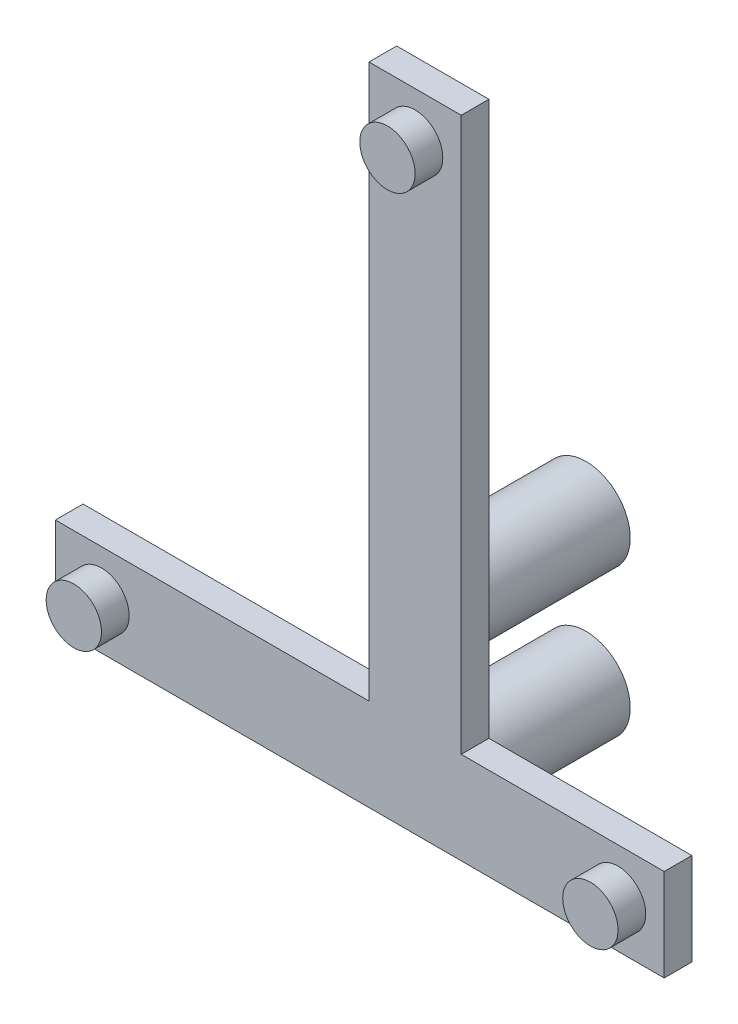
ISO-10303-21;
HEADER;
FILE_DESCRIPTION(('STEP AP214'),'2;1');
FILE_NAME('part.step','',(''),(''),'','','');
FILE_SCHEMA(('AUTOMOTIVE_DESIGN { 1 0 10303 214 1 1 1 1 }'));
ENDSEC;
DATA;
#1=APPLICATION_CONTEXT('core data for automotive mechanical design processes');
#2=APPLICATION_PROTOCOL_DEFINITION('international standard','automotive_design',2000,#1);
#3=PRODUCT_CONTEXT('',#1,'mechanical');
#4=PRODUCT('Part','Part','',(#3));
#5=PRODUCT_RELATED_PRODUCT_CATEGORY('part','',(#4));
#6=PRODUCT_DEFINITION_FORMATION('','',#4);
#7=PRODUCT_DEFINITION_CONTEXT('part definition',#1,'design');
#8=PRODUCT_DEFINITION('design','',#6,#7);
#9=PRODUCT_DEFINITION_SHAPE('','',#8);
#10=(LENGTH_UNIT() NAMED_UNIT(*) SI_UNIT(.MILLI.,.METRE.));
#11=(NAMED_UNIT(*) PLANE_ANGLE_UNIT() SI_UNIT($,.RADIAN.));
#12=(NAMED_UNIT(*) SI_UNIT($,.STERADIAN.) SOLID_ANGLE_UNIT());
#13=UNCERTAINTY_MEASURE_WITH_UNIT(LENGTH_MEASURE(1.E-05),#10,'distance_accuracy_value','');
#14=(GEOMETRIC_REPRESENTATION_CONTEXT(3) GLOBAL_UNCERTAINTY_ASSIGNED_CONTEXT((#13)) GLOBAL_UNIT_ASSIGNED_CONTEXT((#10,
#11,#12)) REPRESENTATION_CONTEXT('',''));
#15=CARTESIAN_POINT('',(0.,0.,0.));
#16=DIRECTION('',(0.,0.,1.));
#17=DIRECTION('',(1.,0.,0.));
#18=AXIS2_PLACEMENT_3D('',#15,#16,#17);
#19=CARTESIAN_POINT('',(-139.561248012313,21.0705350306475,1.5));
#20=DIRECTION('',(1.,0.,0.));
#21=DIRECTION('',(0.,0.,-1.));
#22=AXIS2_PLACEMENT_3D('',#19,#20,#21);
#23=PLANE('',#22);
#24=DIRECTION('',(0.,-1.,0.));
#25=VECTOR('',#24,1.);
#26=CARTESIAN_POINT('',(-139.561248012313,21.0705350306475,0.));
#27=LINE('',#26,#25);
#28=CARTESIAN_POINT('',(-139.561248012313,21.0705350306475,0.));
#29=VERTEX_POINT('',#28);
#30=CARTESIAN_POINT('',(-139.561248012313,16.0705350306475,0.));
#31=VERTEX_POINT('',#30);
#32=EDGE_CURVE('E130',#29,#31,#27,.T.);
#33=ORIENTED_EDGE('',*,*,#32,.T.);
#34=DIRECTION('',(0.,0.,-1.));
#35=VECTOR('',#34,1.);
#36=CARTESIAN_POINT('',(-139.561248012313,16.0705350306475,1.5));
#37=LINE('',#36,#35);
#38=CARTESIAN_POINT('',(-139.561248012313,16.0705350306475,1.5));
#39=VERTEX_POINT('',#38);
#40=EDGE_CURVE('E158',#39,#31,#37,.T.);
#41=ORIENTED_EDGE('',*,*,#40,.F.);
#42=DIRECTION('',(0.,-1.,0.));
#43=VECTOR('',#42,1.);
#44=CARTESIAN_POINT('',(-139.561248012313,21.0705350306475,1.5));
#45=LINE('',#44,#43);
#46=CARTESIAN_POINT('',(-139.561248012313,21.0705350306475,1.5));
#47=VERTEX_POINT('',#46);
#48=EDGE_CURVE('E145',#47,#39,#45,.T.);
#49=ORIENTED_EDGE('',*,*,#48,.F.);
#50=DIRECTION('',(0.,0.,-1.));
#51=VECTOR('',#50,1.);
#52=CARTESIAN_POINT('',(-139.561248012313,21.0705350306475,1.5));
#53=LINE('',#52,#51);
#54=EDGE_CURVE('E126',#47,#29,#53,.T.);
#55=ORIENTED_EDGE('',*,*,#54,.T.);
#56=EDGE_LOOP('',(#33,#41,#49,#55));
#57=FACE_BOUND('',#56,.T.);
#58=ADVANCED_FACE('F33',(#57),#23,.F.);
#59=CARTESIAN_POINT('',(-139.561248012313,16.0705350306475,1.5));
#60=DIRECTION('',(0.,1.,0.));
#61=DIRECTION('',(0.,0.,1.));
#62=AXIS2_PLACEMENT_3D('',#59,#60,#61);
#63=PLANE('',#62);
#64=DIRECTION('',(1.,0.,0.));
#65=VECTOR('',#64,1.);
#66=CARTESIAN_POINT('',(-139.561248012313,16.0705350306475,0.));
#67=LINE('',#66,#65);
#68=CARTESIAN_POINT('',(-106.561248012313,16.0705350306475,0.));
#69=VERTEX_POINT('',#68);
#70=EDGE_CURVE('E133',#31,#69,#67,.T.);
#71=ORIENTED_EDGE('',*,*,#70,.T.);
#72=DIRECTION('',(0.,0.,-1.));
#73=VECTOR('',#72,1.);
#74=CARTESIAN_POINT('',(-106.561248012313,16.0705350306475,1.5));
#75=LINE('',#74,#73);
#76=CARTESIAN_POINT('',(-106.561248012313,16.0705350306475,1.5));
#77=VERTEX_POINT('',#76);
#78=EDGE_CURVE('E155',#77,#69,#75,.T.);
#79=ORIENTED_EDGE('',*,*,#78,.F.);
#80=DIRECTION('',(1.,0.,0.));
#81=VECTOR('',#80,1.);
#82=CARTESIAN_POINT('',(-139.561248012313,16.0705350306475,1.5));
#83=LINE('',#82,#81);
#84=EDGE_CURVE('E93',#39,#77,#83,.T.);
#85=ORIENTED_EDGE('',*,*,#84,.F.);
#86=ORIENTED_EDGE('',*,*,#40,.T.);
#87=EDGE_LOOP('',(#71,#79,#85,#86));
#88=FACE_BOUND('',#87,.T.);
#89=ADVANCED_FACE('F216',(#88),#63,.F.);
#90=CARTESIAN_POINT('',(-106.561248012313,16.0705350306475,1.5));
#91=DIRECTION('',(-1.,0.,0.));
#92=DIRECTION('',(0.,0.,1.));
#93=AXIS2_PLACEMENT_3D('',#90,#91,#92);
#94=PLANE('',#93);
#95=DIRECTION('',(0.,1.,0.));
#96=VECTOR('',#95,1.);
#97=CARTESIAN_POINT('',(-106.561248012313,16.0705350306475,0.));
#98=LINE('',#97,#96);
#99=CARTESIAN_POINT('',(-106.561248012313,21.0705350306475,0.));
#100=VERTEX_POINT('',#99);
#101=EDGE_CURVE('E136',#69,#100,#98,.T.);
#102=ORIENTED_EDGE('',*,*,#101,.T.);
#103=DIRECTION('',(0.,0.,-1.));
#104=VECTOR('',#103,1.);
#105=CARTESIAN_POINT('',(-106.561248012313,21.0705350306475,1.5));
#106=LINE('',#105,#104);
#107=CARTESIAN_POINT('',(-106.561248012313,21.0705350306475,1.5));
#108=VERTEX_POINT('',#107);
#109=EDGE_CURVE('E152',#108,#100,#106,.T.);
#110=ORIENTED_EDGE('',*,*,#109,.F.);
#111=DIRECTION('',(0.,1.,0.));
#112=VECTOR('',#111,1.);
#113=CARTESIAN_POINT('',(-106.561248012313,16.0705350306475,1.5));
#114=LINE('',#113,#112);
#115=EDGE_CURVE('E184',#77,#108,#114,.T.);
#116=ORIENTED_EDGE('',*,*,#115,.F.);
#117=ORIENTED_EDGE('',*,*,#78,.T.);
#118=EDGE_LOOP('',(#102,#110,#116,#117));
#119=FACE_BOUND('',#118,.T.);
#120=ADVANCED_FACE('F220',(#119),#94,.F.);
#121=CARTESIAN_POINT('',(-106.561248012313,21.0705350306475,1.5));
#122=DIRECTION('',(0.,-1.,0.));
#123=DIRECTION('',(1.,0.,0.));
#124=AXIS2_PLACEMENT_3D('',#121,#122,#123);
#125=PLANE('',#124);
#126=DIRECTION('',(-1.,0.,0.));
#127=VECTOR('',#126,1.);
#128=CARTESIAN_POINT('',(-106.561248012313,21.0705350306475,0.));
#129=LINE('',#128,#127);
#130=CARTESIAN_POINT('',(-117.561248012313,21.0705350306475,0.));
#131=VERTEX_POINT('',#130);
#132=EDGE_CURVE('E138',#100,#131,#129,.T.);
#133=ORIENTED_EDGE('',*,*,#132,.T.);
#134=DIRECTION('',(0.,0.,-1.));
#135=VECTOR('',#134,1.);
#136=CARTESIAN_POINT('',(-117.561248012313,21.0705350306475,1.5));
#137=LINE('',#136,#135);
#138=CARTESIAN_POINT('',(-117.561248012313,21.0705350306475,1.5));
#139=VERTEX_POINT('',#138);
#140=EDGE_CURVE('E149',#139,#131,#137,.T.);
#141=ORIENTED_EDGE('',*,*,#140,.F.);
#142=DIRECTION('',(-1.,0.,0.));
#143=VECTOR('',#142,1.);
#144=CARTESIAN_POINT('',(-106.561248012313,21.0705350306475,1.5));
#145=LINE('',#144,#143);
#146=EDGE_CURVE('E186',#108,#139,#145,.T.);
#147=ORIENTED_EDGE('',*,*,#146,.F.);
#148=ORIENTED_EDGE('',*,*,#109,.T.);
#149=EDGE_LOOP('',(#133,#141,#147,#148));
#150=FACE_BOUND('',#149,.T.);
#151=ADVANCED_FACE('F192',(#150),#125,.F.);
#152=CARTESIAN_POINT('',(-117.561248012313,21.0705350306475,1.5));
#153=DIRECTION('',(-1.,0.,0.));
#154=DIRECTION('',(0.,-1.,0.));
#155=AXIS2_PLACEMENT_3D('',#152,#153,#154);
#156=PLANE('',#155);
#157=DIRECTION('',(0.,1.,0.));
#158=VECTOR('',#157,1.);
#159=CARTESIAN_POINT('',(-117.561248012313,21.0705350306475,0.));
#160=LINE('',#159,#158);
#161=CARTESIAN_POINT('',(-117.561248012313,51.0705350306475,0.));
#162=VERTEX_POINT('',#161);
#163=EDGE_CURVE('E140',#131,#162,#160,.T.);
#164=ORIENTED_EDGE('',*,*,#163,.T.);
#165=DIRECTION('',(0.,0.,-1.));
#166=VECTOR('',#165,1.);
#167=CARTESIAN_POINT('',(-117.561248012313,51.0705350306475,1.5));
#168=LINE('',#167,#166);
#169=CARTESIAN_POINT('',(-117.561248012313,51.0705350306475,1.5));
#170=VERTEX_POINT('',#169);
#171=EDGE_CURVE('E121',#170,#162,#168,.T.);
#172=ORIENTED_EDGE('',*,*,#171,.F.);
#173=DIRECTION('',(0.,1.,0.));
#174=VECTOR('',#173,1.);
#175=CARTESIAN_POINT('',(-117.561248012313,21.0705350306475,1.5));
#176=LINE('',#175,#174);
#177=EDGE_CURVE('E112',#139,#170,#176,.T.);
#178=ORIENTED_EDGE('',*,*,#177,.F.);
#179=ORIENTED_EDGE('',*,*,#140,.T.);
#180=EDGE_LOOP('',(#164,#172,#178,#179));
#181=FACE_BOUND('',#180,.T.);
#182=ADVANCED_FACE('F196',(#181),#156,.F.);
#183=CARTESIAN_POINT('',(-117.561248012313,51.0705350306475,1.5));
#184=DIRECTION('',(0.,-1.,0.));
#185=DIRECTION('',(0.,0.,-1.));
#186=AXIS2_PLACEMENT_3D('',#183,#184,#185);
#187=PLANE('',#186);
#188=DIRECTION('',(-1.,0.,0.));
#189=VECTOR('',#188,1.);
#190=CARTESIAN_POINT('',(-117.561248012313,51.0705350306475,0.));
#191=LINE('',#190,#189);
#192=CARTESIAN_POINT('',(-122.561248012313,51.0705350306475,0.));
#193=VERTEX_POINT('',#192);
#194=EDGE_CURVE('E120',#162,#193,#191,.T.);
#195=ORIENTED_EDGE('',*,*,#194,.T.);
#196=DIRECTION('',(0.,0.,-1.));
#197=VECTOR('',#196,1.);
#198=CARTESIAN_POINT('',(-122.561248012313,51.0705350306475,1.5));
#199=LINE('',#198,#197);
#200=CARTESIAN_POINT('',(-122.561248012313,51.0705350306475,1.5));
#201=VERTEX_POINT('',#200);
#202=EDGE_CURVE('E117',#201,#193,#199,.T.);
#203=ORIENTED_EDGE('',*,*,#202,.F.);
#204=DIRECTION('',(-1.,0.,0.));
#205=VECTOR('',#204,1.);
#206=CARTESIAN_POINT('',(-117.561248012313,51.0705350306475,1.5));
#207=LINE('',#206,#205);
#208=EDGE_CURVE('E106',#170,#201,#207,.T.);
#209=ORIENTED_EDGE('',*,*,#208,.F.);
#210=ORIENTED_EDGE('',*,*,#171,.T.);
#211=EDGE_LOOP('',(#195,#203,#209,#210));
#212=FACE_BOUND('',#211,.T.);
#213=ADVANCED_FACE('F118',(#212),#187,.F.);
#214=CARTESIAN_POINT('',(-122.561248012313,51.0705350306475,1.5));
#215=DIRECTION('',(1.,0.,0.));
#216=DIRECTION('',(0.,1.,0.));
#217=AXIS2_PLACEMENT_3D('',#214,#215,#216);
#218=PLANE('',#217);
#219=DIRECTION('',(0.,-1.,0.));
#220=VECTOR('',#219,1.);
#221=CARTESIAN_POINT('',(-122.561248012313,51.0705350306475,0.));
#222=LINE('',#221,#220);
#223=CARTESIAN_POINT('',(-122.561248012313,21.0705350306475,0.));
#224=VERTEX_POINT('',#223);
#225=EDGE_CURVE('E78',#193,#224,#222,.T.);
#226=ORIENTED_EDGE('',*,*,#225,.T.);
#227=DIRECTION('',(0.,0.,-1.));
#228=VECTOR('',#227,1.);
#229=CARTESIAN_POINT('',(-122.561248012313,21.0705350306475,1.5));
#230=LINE('',#229,#228);
#231=CARTESIAN_POINT('',(-122.561248012313,21.0705350306475,1.5));
#232=VERTEX_POINT('',#231);
#233=EDGE_CURVE('E122',#232,#224,#230,.T.);
#234=ORIENTED_EDGE('',*,*,#233,.F.);
#235=DIRECTION('',(0.,-1.,0.));
#236=VECTOR('',#235,1.);
#237=CARTESIAN_POINT('',(-122.561248012313,51.0705350306475,1.5));
#238=LINE('',#237,#236);
#239=EDGE_CURVE('E110',#201,#232,#238,.T.);
#240=ORIENTED_EDGE('',*,*,#239,.F.);
#241=ORIENTED_EDGE('',*,*,#202,.T.);
#242=EDGE_LOOP('',(#226,#234,#240,#241));
#243=FACE_BOUND('',#242,.T.);
#244=ADVANCED_FACE('F124',(#243),#218,.F.);
#245=CARTESIAN_POINT('',(-122.561248012313,21.0705350306475,1.5));
#246=DIRECTION('',(0.,-1.,0.));
#247=DIRECTION('',(1.,0.,0.));
#248=AXIS2_PLACEMENT_3D('',#245,#246,#247);
#249=PLANE('',#248);
#250=DIRECTION('',(-1.,0.,0.));
#251=VECTOR('',#250,1.);
#252=CARTESIAN_POINT('',(-122.561248012313,21.0705350306475,0.));
#253=LINE('',#252,#251);
#254=EDGE_CURVE('E84',#224,#29,#253,.T.);
#255=ORIENTED_EDGE('',*,*,#254,.T.);
#256=ORIENTED_EDGE('',*,*,#54,.F.);
#257=DIRECTION('',(-1.,0.,0.));
#258=VECTOR('',#257,1.);
#259=CARTESIAN_POINT('',(-122.561248012313,21.0705350306475,1.5));
#260=LINE('',#259,#258);
#261=EDGE_CURVE('E49',#232,#47,#260,.T.);
#262=ORIENTED_EDGE('',*,*,#261,.F.);
#263=ORIENTED_EDGE('',*,*,#233,.T.);
#264=EDGE_LOOP('',(#255,#256,#262,#263));
#265=FACE_BOUND('',#264,.T.);
#266=ADVANCED_FACE('F204',(#265),#249,.F.);
#267=CARTESIAN_POINT('',(0.,0.,1.5));
#268=DIRECTION('',(0.,0.,1.));
#269=DIRECTION('',(1.,0.,0.));
#270=AXIS2_PLACEMENT_3D('',#267,#268,#269);
#271=PLANE('',#270);
#272=CARTESIAN_POINT('',(-120.061248012313,48.5705350306475,1.5));
#273=DIRECTION('',(0.,0.,1.));
#274=DIRECTION('',(1.,0.,0.));
#275=AXIS2_PLACEMENT_3D('',#272,#273,#274);
#276=CIRCLE('',#275,1.5);
#277=CARTESIAN_POINT('',(-118.561248012313,48.5705350306475,1.5));
#278=VERTEX_POINT('',#277);
#279=EDGE_CURVE('E161',#278,#278,#276,.T.);
#280=ORIENTED_EDGE('',*,*,#279,.F.);
#281=EDGE_LOOP('',(#280));
#282=FACE_BOUND('',#281,.T.);
#283=CARTESIAN_POINT('',(-109.061248012313,18.5705350306475,1.5));
#284=DIRECTION('',(0.,0.,1.));
#285=DIRECTION('',(1.,0.,0.));
#286=AXIS2_PLACEMENT_3D('',#283,#284,#285);
#287=CIRCLE('',#286,1.5);
#288=CARTESIAN_POINT('',(-107.561248012313,18.5705350306475,1.5));
#289=VERTEX_POINT('',#288);
#290=EDGE_CURVE('E165',#289,#289,#287,.T.);
#291=ORIENTED_EDGE('',*,*,#290,.F.);
#292=EDGE_LOOP('',(#291));
#293=FACE_BOUND('',#292,.T.);
#294=CARTESIAN_POINT('',(-137.061248012313,18.5705350306475,1.5));
#295=DIRECTION('',(0.,0.,1.));
#296=DIRECTION('',(1.,0.,0.));
#297=AXIS2_PLACEMENT_3D('',#294,#295,#296);
#298=CIRCLE('',#297,1.5);
#299=CARTESIAN_POINT('',(-135.561248012313,18.5705350306475,1.5));
#300=VERTEX_POINT('',#299);
#301=EDGE_CURVE('E159',#300,#300,#298,.T.);
#302=ORIENTED_EDGE('',*,*,#301,.F.);
#303=EDGE_LOOP('',(#302));
#304=FACE_BOUND('',#303,.T.);
#305=ORIENTED_EDGE('',*,*,#48,.T.);
#306=ORIENTED_EDGE('',*,*,#84,.T.);
#307=ORIENTED_EDGE('',*,*,#115,.T.);
#308=ORIENTED_EDGE('',*,*,#146,.T.);
#309=ORIENTED_EDGE('',*,*,#177,.T.);
#310=ORIENTED_EDGE('',*,*,#208,.T.);
#311=ORIENTED_EDGE('',*,*,#239,.T.);
#312=ORIENTED_EDGE('',*,*,#261,.T.);
#313=EDGE_LOOP('',(#305,#306,#307,#308,#309,#310,#311,#312));
#314=FACE_BOUND('',#313,.T.);
#315=ADVANCED_FACE('F108',(#282,#293,#304,#314),#271,.T.);
#316=CARTESIAN_POINT('',(0.,0.,0.));
#317=DIRECTION('',(0.,0.,1.));
#318=DIRECTION('',(1.,0.,0.));
#319=AXIS2_PLACEMENT_3D('',#316,#317,#318);
#320=PLANE('',#319);
#321=CARTESIAN_POINT('',(-120.061248012313,26.5405350306475,0.));
#322=DIRECTION('',(0.,0.,1.));
#323=DIRECTION('',(1.,0.,0.));
#324=AXIS2_PLACEMENT_3D('',#321,#322,#323);
#325=CIRCLE('',#324,2.4);
#326=CARTESIAN_POINT('',(-117.661248012313,26.5405350306475,0.));
#327=VERTEX_POINT('',#326);
#328=EDGE_CURVE('E11',#327,#327,#325,.F.);
#329=ORIENTED_EDGE('',*,*,#328,.F.);
#330=EDGE_LOOP('',(#329));
#331=FACE_BOUND('',#330,.T.);
#332=CARTESIAN_POINT('',(-120.061248012313,18.5705350306475,0.));
#333=DIRECTION('',(0.,0.,1.));
#334=DIRECTION('',(1.,0.,0.));
#335=AXIS2_PLACEMENT_3D('',#332,#333,#334);
#336=CIRCLE('',#335,2.4);
#337=CARTESIAN_POINT('',(-117.661248012313,18.5705350306475,0.));
#338=VERTEX_POINT('',#337);
#339=EDGE_CURVE('E41',#338,#338,#336,.F.);
#340=ORIENTED_EDGE('',*,*,#339,.F.);
#341=EDGE_LOOP('',(#340));
#342=FACE_BOUND('',#341,.T.);
#343=ORIENTED_EDGE('',*,*,#32,.F.);
#344=ORIENTED_EDGE('',*,*,#254,.F.);
#345=ORIENTED_EDGE('',*,*,#225,.F.);
#346=ORIENTED_EDGE('',*,*,#194,.F.);
#347=ORIENTED_EDGE('',*,*,#163,.F.);
#348=ORIENTED_EDGE('',*,*,#132,.F.);
#349=ORIENTED_EDGE('',*,*,#101,.F.);
#350=ORIENTED_EDGE('',*,*,#70,.F.);
#351=EDGE_LOOP('',(#343,#344,#345,#346,#347,#348,#349,#350));
#352=FACE_BOUND('',#351,.T.);
#353=ADVANCED_FACE('F199',(#331,#342,#352),#320,.F.);
#354=CARTESIAN_POINT('',(-137.061248012313,18.5705350306475,3.));
#355=DIRECTION('',(0.,0.,-1.));
#356=DIRECTION('',(-1.,0.,0.));
#357=AXIS2_PLACEMENT_3D('',#354,#355,#356);
#358=CYLINDRICAL_SURFACE('',#357,1.5);
#359=ORIENTED_EDGE('',*,*,#301,.T.);
#360=EDGE_LOOP('',(#359));
#361=FACE_BOUND('',#360,.T.);
#362=CARTESIAN_POINT('',(-137.061248012313,18.5705350306475,3.));
#363=DIRECTION('',(0.,0.,-1.));
#364=DIRECTION('',(-1.,0.,0.));
#365=AXIS2_PLACEMENT_3D('',#362,#363,#364);
#366=CIRCLE('',#365,1.5);
#367=CARTESIAN_POINT('',(-138.561248012313,18.5705350306475,3.));
#368=VERTEX_POINT('',#367);
#369=EDGE_CURVE('E134',#368,#368,#366,.T.);
#370=ORIENTED_EDGE('',*,*,#369,.T.);
#371=EDGE_LOOP('',(#370));
#372=FACE_BOUND('',#371,.T.);
#373=ADVANCED_FACE('F257',(#361,#372),#358,.T.);
#374=CARTESIAN_POINT('',(-137.061248012313,18.5705350306475,3.));
#375=DIRECTION('',(0.,0.,-1.));
#376=DIRECTION('',(-1.,0.,0.));
#377=AXIS2_PLACEMENT_3D('',#374,#375,#376);
#378=PLANE('',#377);
#379=ORIENTED_EDGE('',*,*,#369,.F.);
#380=EDGE_LOOP('',(#379));
#381=FACE_BOUND('',#380,.T.);
#382=ADVANCED_FACE('F262',(#381),#378,.F.);
#383=CARTESIAN_POINT('',(-109.061248012313,18.5705350306475,3.));
#384=DIRECTION('',(0.,0.,-1.));
#385=DIRECTION('',(-1.,0.,0.));
#386=AXIS2_PLACEMENT_3D('',#383,#384,#385);
#387=CYLINDRICAL_SURFACE('',#386,1.5);
#388=ORIENTED_EDGE('',*,*,#290,.T.);
#389=EDGE_LOOP('',(#388));
#390=FACE_BOUND('',#389,.T.);
#391=CARTESIAN_POINT('',(-109.061248012313,18.5705350306475,3.));
#392=DIRECTION('',(0.,0.,-1.));
#393=DIRECTION('',(-1.,0.,0.));
#394=AXIS2_PLACEMENT_3D('',#391,#392,#393);
#395=CIRCLE('',#394,1.5);
#396=CARTESIAN_POINT('',(-110.561248012313,18.5705350306475,3.));
#397=VERTEX_POINT('',#396);
#398=EDGE_CURVE('E175',#397,#397,#395,.T.);
#399=ORIENTED_EDGE('',*,*,#398,.T.);
#400=EDGE_LOOP('',(#399));
#401=FACE_BOUND('',#400,.T.);
#402=ADVANCED_FACE('F272',(#390,#401),#387,.T.);
#403=CARTESIAN_POINT('',(-109.061248012313,18.5705350306475,3.));
#404=DIRECTION('',(0.,0.,-1.));
#405=DIRECTION('',(-1.,0.,0.));
#406=AXIS2_PLACEMENT_3D('',#403,#404,#405);
#407=PLANE('',#406);
#408=ORIENTED_EDGE('',*,*,#398,.F.);
#409=EDGE_LOOP('',(#408));
#410=FACE_BOUND('',#409,.T.);
#411=ADVANCED_FACE('F282',(#410),#407,.F.);
#412=CARTESIAN_POINT('',(-120.061248012313,48.5705350306475,3.));
#413=DIRECTION('',(0.,0.,-1.));
#414=DIRECTION('',(-1.,0.,0.));
#415=AXIS2_PLACEMENT_3D('',#412,#413,#414);
#416=CYLINDRICAL_SURFACE('',#415,1.5);
#417=ORIENTED_EDGE('',*,*,#279,.T.);
#418=EDGE_LOOP('',(#417));
#419=FACE_BOUND('',#418,.T.);
#420=CARTESIAN_POINT('',(-120.061248012313,48.5705350306475,3.));
#421=DIRECTION('',(0.,0.,-1.));
#422=DIRECTION('',(-1.,0.,0.));
#423=AXIS2_PLACEMENT_3D('',#420,#421,#422);
#424=CIRCLE('',#423,1.5);
#425=CARTESIAN_POINT('',(-121.561248012313,48.5705350306475,3.));
#426=VERTEX_POINT('',#425);
#427=EDGE_CURVE('E173',#426,#426,#424,.T.);
#428=ORIENTED_EDGE('',*,*,#427,.T.);
#429=EDGE_LOOP('',(#428));
#430=FACE_BOUND('',#429,.T.);
#431=ADVANCED_FACE('F292',(#419,#430),#416,.T.);
#432=CARTESIAN_POINT('',(-120.061248012313,48.5705350306475,3.));
#433=DIRECTION('',(0.,0.,-1.));
#434=DIRECTION('',(-1.,0.,0.));
#435=AXIS2_PLACEMENT_3D('',#432,#433,#434);
#436=PLANE('',#435);
#437=ORIENTED_EDGE('',*,*,#427,.F.);
#438=EDGE_LOOP('',(#437));
#439=FACE_BOUND('',#438,.T.);
#440=ADVANCED_FACE('F302',(#439),#436,.F.);
#441=CARTESIAN_POINT('',(-120.061248012313,18.5705350306475,-7.76));
#442=DIRECTION('',(0.,0.,1.));
#443=DIRECTION('',(1.,0.,0.));
#444=AXIS2_PLACEMENT_3D('',#441,#442,#443);
#445=CYLINDRICAL_SURFACE('',#444,2.4);
#446=CARTESIAN_POINT('',(-120.061248012313,18.5705350306475,-7.76));
#447=DIRECTION('',(0.,0.,-1.));
#448=DIRECTION('',(-1.,0.,0.));
#449=AXIS2_PLACEMENT_3D('',#446,#447,#448);
#450=CIRCLE('',#449,2.4);
#451=CARTESIAN_POINT('',(-122.461248012313,18.5705350306475,-7.76));
#452=VERTEX_POINT('',#451);
#453=EDGE_CURVE('E362',#452,#452,#450,.T.);
#454=ORIENTED_EDGE('',*,*,#453,.F.);
#455=EDGE_LOOP('',(#454));
#456=FACE_BOUND('',#455,.T.);
#457=ORIENTED_EDGE('',*,*,#339,.T.);
#458=EDGE_LOOP('',(#457));
#459=FACE_BOUND('',#458,.T.);
#460=ADVANCED_FACE('F311',(#456,#459),#445,.T.);
#461=CARTESIAN_POINT('',(-120.061248012313,18.5705350306475,-7.76));
#462=DIRECTION('',(0.,0.,-1.));
#463=DIRECTION('',(-1.,0.,0.));
#464=AXIS2_PLACEMENT_3D('',#461,#462,#463);
#465=PLANE('',#464);
#466=ORIENTED_EDGE('',*,*,#453,.T.);
#467=EDGE_LOOP('',(#466));
#468=FACE_BOUND('',#467,.T.);
#469=ADVANCED_FACE('F325',(#468),#465,.T.);
#470=CARTESIAN_POINT('',(-120.061248012313,26.5405350306475,-7.76));
#471=DIRECTION('',(0.,0.,1.));
#472=DIRECTION('',(1.,0.,0.));
#473=AXIS2_PLACEMENT_3D('',#470,#471,#472);
#474=CYLINDRICAL_SURFACE('',#473,2.4);
#475=CARTESIAN_POINT('',(-120.061248012313,26.5405350306475,-7.76));
#476=DIRECTION('',(0.,0.,-1.));
#477=DIRECTION('',(-1.,0.,0.));
#478=AXIS2_PLACEMENT_3D('',#475,#476,#477);
#479=CIRCLE('',#478,2.4);
#480=CARTESIAN_POINT('',(-122.461248012313,26.5405350306475,-7.76));
#481=VERTEX_POINT('',#480);
#482=EDGE_CURVE('E361',#481,#481,#479,.T.);
#483=ORIENTED_EDGE('',*,*,#482,.F.);
#484=EDGE_LOOP('',(#483));
#485=FACE_BOUND('',#484,.T.);
#486=ORIENTED_EDGE('',*,*,#328,.T.);
#487=EDGE_LOOP('',(#486));
#488=FACE_BOUND('',#487,.T.);
#489=ADVANCED_FACE('F335',(#485,#488),#474,.T.);
#490=CARTESIAN_POINT('',(-120.061248012313,26.5405350306475,-7.76));
#491=DIRECTION('',(0.,0.,-1.));
#492=DIRECTION('',(-1.,0.,0.));
#493=AXIS2_PLACEMENT_3D('',#490,#491,#492);
#494=PLANE('',#493);
#495=ORIENTED_EDGE('',*,*,#482,.T.);
#496=EDGE_LOOP('',(#495));
#497=FACE_BOUND('',#496,.T.);
#498=ADVANCED_FACE('F345',(#497),#494,.T.);
#499=CLOSED_SHELL('',(#58,#89,#120,#151,#182,#213,#244,#266,#315,#353,#373,#382,#402,#411,#431,
#440,#460,#469,#489,#498));
#500=MANIFOLD_SOLID_BREP('B2',#499);
#501=ADVANCED_BREP_SHAPE_REPRESENTATION('',(#18,#500),#14);
#502=SHAPE_DEFINITION_REPRESENTATION(#9,#501);
ENDSEC;
END-ISO-10303-21;
